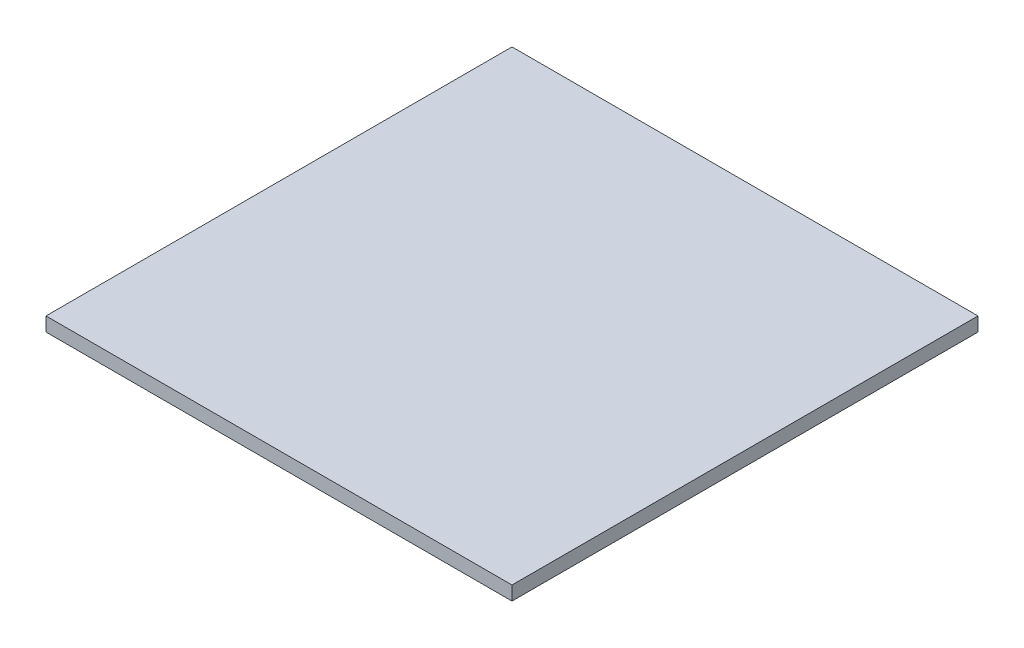
ISO-10303-21;
HEADER;
FILE_DESCRIPTION(('STEP AP214'),'2;1');
FILE_NAME('part.step','',(''),(''),'','','');
FILE_SCHEMA(('AUTOMOTIVE_DESIGN { 1 0 10303 214 1 1 1 1 }'));
ENDSEC;
DATA;
#1=APPLICATION_CONTEXT('core data for automotive mechanical design processes');
#2=APPLICATION_PROTOCOL_DEFINITION('international standard','automotive_design',2000,#1);
#3=PRODUCT_CONTEXT('',#1,'mechanical');
#4=PRODUCT('Part','Part','',(#3));
#5=PRODUCT_RELATED_PRODUCT_CATEGORY('part','',(#4));
#6=PRODUCT_DEFINITION_FORMATION('','',#4);
#7=PRODUCT_DEFINITION_CONTEXT('part definition',#1,'design');
#8=PRODUCT_DEFINITION('design','',#6,#7);
#9=PRODUCT_DEFINITION_SHAPE('','',#8);
#10=(LENGTH_UNIT() NAMED_UNIT(*) SI_UNIT(.MILLI.,.METRE.));
#11=(NAMED_UNIT(*) PLANE_ANGLE_UNIT() SI_UNIT($,.RADIAN.));
#12=(NAMED_UNIT(*) SI_UNIT($,.STERADIAN.) SOLID_ANGLE_UNIT());
#13=UNCERTAINTY_MEASURE_WITH_UNIT(LENGTH_MEASURE(1.E-05),#10,'distance_accuracy_value','');
#14=(GEOMETRIC_REPRESENTATION_CONTEXT(3) GLOBAL_UNCERTAINTY_ASSIGNED_CONTEXT((#13)) GLOBAL_UNIT_ASSIGNED_CONTEXT((#10,
#11,#12)) REPRESENTATION_CONTEXT('',''));
#15=CARTESIAN_POINT('',(0.,0.,0.));
#16=DIRECTION('',(0.,0.,1.));
#17=DIRECTION('',(1.,0.,0.));
#18=AXIS2_PLACEMENT_3D('',#15,#16,#17);
#19=CARTESIAN_POINT('',(-80.2631578947368,3.,-43.75));
#20=DIRECTION('',(1.,0.,0.));
#21=DIRECTION('',(0.,0.,-1.));
#22=AXIS2_PLACEMENT_3D('',#19,#20,#21);
#23=PLANE('',#22);
#24=DIRECTION('',(0.,0.,1.));
#25=VECTOR('',#24,1.);
#26=CARTESIAN_POINT('',(-80.2631578947368,0.,-43.75));
#27=LINE('',#26,#25);
#28=CARTESIAN_POINT('',(-80.2631578947368,0.,-43.75));
#29=VERTEX_POINT('',#28);
#30=CARTESIAN_POINT('',(-80.2631578947368,0.,56.25));
#31=VERTEX_POINT('',#30);
#32=EDGE_CURVE('E113',#29,#31,#27,.T.);
#33=ORIENTED_EDGE('',*,*,#32,.T.);
#34=DIRECTION('',(0.,-1.,0.));
#35=VECTOR('',#34,1.);
#36=CARTESIAN_POINT('',(-80.2631578947368,3.,56.25));
#37=LINE('',#36,#35);
#38=CARTESIAN_POINT('',(-80.2631578947368,3.,56.25));
#39=VERTEX_POINT('',#38);
#40=EDGE_CURVE('E11',#39,#31,#37,.T.);
#41=ORIENTED_EDGE('',*,*,#40,.F.);
#42=DIRECTION('',(0.,0.,1.));
#43=VECTOR('',#42,1.);
#44=CARTESIAN_POINT('',(-80.2631578947368,3.,-43.75));
#45=LINE('',#44,#43);
#46=CARTESIAN_POINT('',(-80.2631578947368,3.,-43.75));
#47=VERTEX_POINT('',#46);
#48=EDGE_CURVE('E97',#47,#39,#45,.T.);
#49=ORIENTED_EDGE('',*,*,#48,.F.);
#50=DIRECTION('',(0.,-1.,0.));
#51=VECTOR('',#50,1.);
#52=CARTESIAN_POINT('',(-80.2631578947368,3.,-43.75));
#53=LINE('',#52,#51);
#54=EDGE_CURVE('E109',#47,#29,#53,.T.);
#55=ORIENTED_EDGE('',*,*,#54,.T.);
#56=EDGE_LOOP('',(#33,#41,#49,#55));
#57=FACE_BOUND('',#56,.T.);
#58=ADVANCED_FACE('F45',(#57),#23,.F.);
#59=CARTESIAN_POINT('',(-80.2631578947368,3.,56.25));
#60=DIRECTION('',(0.,0.,-1.));
#61=DIRECTION('',(-1.,0.,0.));
#62=AXIS2_PLACEMENT_3D('',#59,#60,#61);
#63=PLANE('',#62);
#64=DIRECTION('',(1.,0.,0.));
#65=VECTOR('',#64,1.);
#66=CARTESIAN_POINT('',(-80.2631578947368,0.,56.25));
#67=LINE('',#66,#65);
#68=CARTESIAN_POINT('',(19.7368421052632,0.,56.25));
#69=VERTEX_POINT('',#68);
#70=EDGE_CURVE('E102',#31,#69,#67,.T.);
#71=ORIENTED_EDGE('',*,*,#70,.T.);
#72=DIRECTION('',(0.,-1.,0.));
#73=VECTOR('',#72,1.);
#74=CARTESIAN_POINT('',(19.7368421052632,3.,56.25));
#75=LINE('',#74,#73);
#76=CARTESIAN_POINT('',(19.7368421052632,3.,56.25));
#77=VERTEX_POINT('',#76);
#78=EDGE_CURVE('E54',#77,#69,#75,.T.);
#79=ORIENTED_EDGE('',*,*,#78,.F.);
#80=DIRECTION('',(1.,0.,0.));
#81=VECTOR('',#80,1.);
#82=CARTESIAN_POINT('',(-80.2631578947368,3.,56.25));
#83=LINE('',#82,#81);
#84=EDGE_CURVE('E92',#39,#77,#83,.T.);
#85=ORIENTED_EDGE('',*,*,#84,.F.);
#86=ORIENTED_EDGE('',*,*,#40,.T.);
#87=EDGE_LOOP('',(#71,#79,#85,#86));
#88=FACE_BOUND('',#87,.T.);
#89=ADVANCED_FACE('F101',(#88),#63,.F.);
#90=CARTESIAN_POINT('',(19.7368421052632,3.,-43.75));
#91=DIRECTION('',(-1.,0.,0.));
#92=DIRECTION('',(0.,0.,1.));
#93=AXIS2_PLACEMENT_3D('',#90,#91,#92);
#94=PLANE('',#93);
#95=DIRECTION('',(0.,0.,-1.));
#96=VECTOR('',#95,1.);
#97=CARTESIAN_POINT('',(19.7368421052632,0.,-43.75));
#98=LINE('',#97,#96);
#99=CARTESIAN_POINT('',(19.7368421052632,0.,-43.75));
#100=VERTEX_POINT('',#99);
#101=EDGE_CURVE('E79',#69,#100,#98,.T.);
#102=ORIENTED_EDGE('',*,*,#101,.T.);
#103=DIRECTION('',(0.,-1.,0.));
#104=VECTOR('',#103,1.);
#105=CARTESIAN_POINT('',(19.7368421052632,3.,-43.75));
#106=LINE('',#105,#104);
#107=CARTESIAN_POINT('',(19.7368421052632,3.,-43.75));
#108=VERTEX_POINT('',#107);
#109=EDGE_CURVE('E104',#108,#100,#106,.T.);
#110=ORIENTED_EDGE('',*,*,#109,.F.);
#111=DIRECTION('',(0.,0.,-1.));
#112=VECTOR('',#111,1.);
#113=CARTESIAN_POINT('',(19.7368421052632,3.,-43.75));
#114=LINE('',#113,#112);
#115=EDGE_CURVE('E95',#77,#108,#114,.T.);
#116=ORIENTED_EDGE('',*,*,#115,.F.);
#117=ORIENTED_EDGE('',*,*,#78,.T.);
#118=EDGE_LOOP('',(#102,#110,#116,#117));
#119=FACE_BOUND('',#118,.T.);
#120=ADVANCED_FACE('F105',(#119),#94,.F.);
#121=CARTESIAN_POINT('',(-80.2631578947368,3.,-43.75));
#122=DIRECTION('',(0.,0.,1.));
#123=DIRECTION('',(1.,0.,0.));
#124=AXIS2_PLACEMENT_3D('',#121,#122,#123);
#125=PLANE('',#124);
#126=DIRECTION('',(-1.,0.,0.));
#127=VECTOR('',#126,1.);
#128=CARTESIAN_POINT('',(-80.2631578947368,0.,-43.75));
#129=LINE('',#128,#127);
#130=EDGE_CURVE('E85',#100,#29,#129,.T.);
#131=ORIENTED_EDGE('',*,*,#130,.T.);
#132=ORIENTED_EDGE('',*,*,#54,.F.);
#133=DIRECTION('',(-1.,0.,0.));
#134=VECTOR('',#133,1.);
#135=CARTESIAN_POINT('',(-80.2631578947368,3.,-43.75));
#136=LINE('',#135,#134);
#137=EDGE_CURVE('E62',#108,#47,#136,.T.);
#138=ORIENTED_EDGE('',*,*,#137,.F.);
#139=ORIENTED_EDGE('',*,*,#109,.T.);
#140=EDGE_LOOP('',(#131,#132,#138,#139));
#141=FACE_BOUND('',#140,.T.);
#142=ADVANCED_FACE('F126',(#141),#125,.F.);
#143=CARTESIAN_POINT('',(0.,3.,0.));
#144=DIRECTION('',(0.,1.,0.));
#145=DIRECTION('',(0.,0.,1.));
#146=AXIS2_PLACEMENT_3D('',#143,#144,#145);
#147=PLANE('',#146);
#148=ORIENTED_EDGE('',*,*,#48,.T.);
#149=ORIENTED_EDGE('',*,*,#84,.T.);
#150=ORIENTED_EDGE('',*,*,#115,.T.);
#151=ORIENTED_EDGE('',*,*,#137,.T.);
#152=EDGE_LOOP('',(#148,#149,#150,#151));
#153=FACE_BOUND('',#152,.T.);
#154=ADVANCED_FACE('F93',(#153),#147,.T.);
#155=CARTESIAN_POINT('',(0.,0.,0.));
#156=DIRECTION('',(0.,1.,0.));
#157=DIRECTION('',(0.,0.,1.));
#158=AXIS2_PLACEMENT_3D('',#155,#156,#157);
#159=PLANE('',#158);
#160=ORIENTED_EDGE('',*,*,#32,.F.);
#161=ORIENTED_EDGE('',*,*,#130,.F.);
#162=ORIENTED_EDGE('',*,*,#101,.F.);
#163=ORIENTED_EDGE('',*,*,#70,.F.);
#164=EDGE_LOOP('',(#160,#161,#162,#163));
#165=FACE_BOUND('',#164,.T.);
#166=ADVANCED_FACE('F129',(#165),#159,.F.);
#167=CLOSED_SHELL('',(#58,#89,#120,#142,#154,#166));
#168=MANIFOLD_SOLID_BREP('B2',#167);
#169=ADVANCED_BREP_SHAPE_REPRESENTATION('',(#18,#168),#14);
#170=SHAPE_DEFINITION_REPRESENTATION(#9,#169);
ENDSEC;
END-ISO-10303-21;
